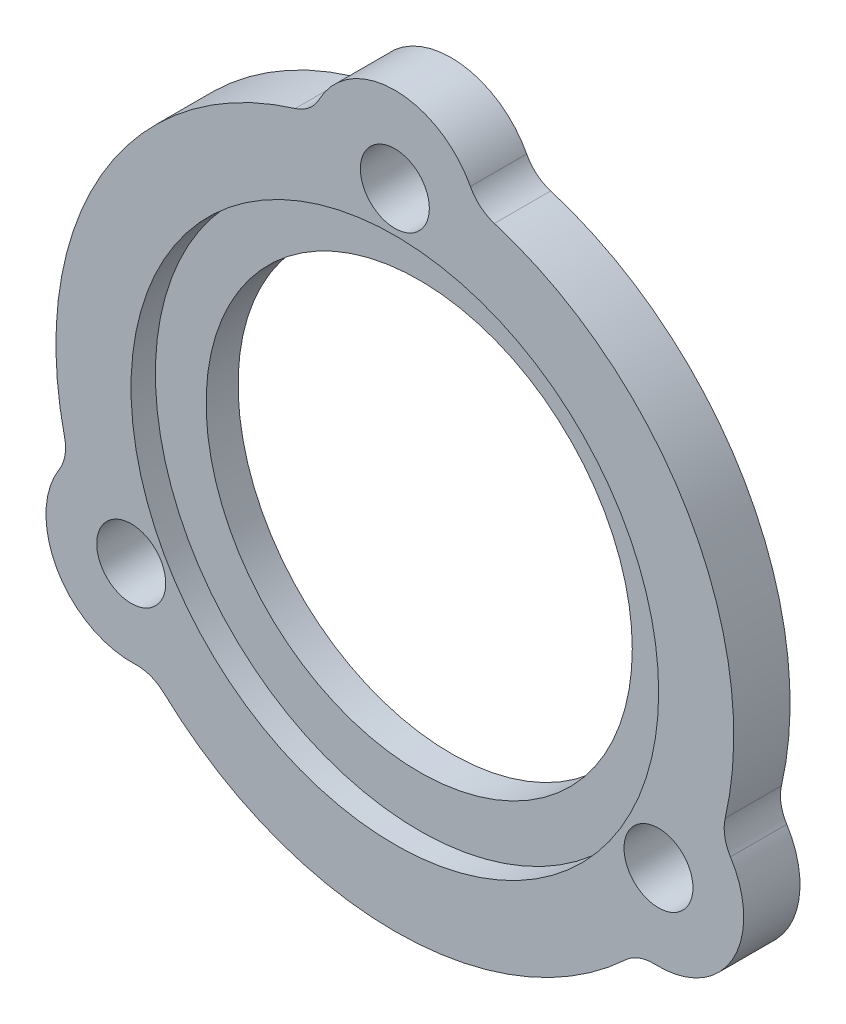
ISO-10303-21;
HEADER;
FILE_DESCRIPTION(('STEP AP214'),'2;1');
FILE_NAME('part.step','',(''),(''),'','','');
FILE_SCHEMA(('AUTOMOTIVE_DESIGN { 1 0 10303 214 1 1 1 1 }'));
ENDSEC;
DATA;
#1=APPLICATION_CONTEXT('core data for automotive mechanical design processes');
#2=APPLICATION_PROTOCOL_DEFINITION('international standard','automotive_design',2000,#1);
#3=PRODUCT_CONTEXT('',#1,'mechanical');
#4=PRODUCT('Part','Part','',(#3));
#5=PRODUCT_RELATED_PRODUCT_CATEGORY('part','',(#4));
#6=PRODUCT_DEFINITION_FORMATION('','',#4);
#7=PRODUCT_DEFINITION_CONTEXT('part definition',#1,'design');
#8=PRODUCT_DEFINITION('design','',#6,#7);
#9=PRODUCT_DEFINITION_SHAPE('','',#8);
#10=(LENGTH_UNIT() NAMED_UNIT(*) SI_UNIT(.MILLI.,.METRE.));
#11=(NAMED_UNIT(*) PLANE_ANGLE_UNIT() SI_UNIT($,.RADIAN.));
#12=(NAMED_UNIT(*) SI_UNIT($,.STERADIAN.) SOLID_ANGLE_UNIT());
#13=UNCERTAINTY_MEASURE_WITH_UNIT(LENGTH_MEASURE(1.E-05),#10,'distance_accuracy_value','');
#14=(GEOMETRIC_REPRESENTATION_CONTEXT(3) GLOBAL_UNCERTAINTY_ASSIGNED_CONTEXT((#13)) GLOBAL_UNIT_ASSIGNED_CONTEXT((#10,
#11,#12)) REPRESENTATION_CONTEXT('',''));
#15=CARTESIAN_POINT('',(0.,0.,0.));
#16=DIRECTION('',(0.,0.,1.));
#17=DIRECTION('',(1.,0.,0.));
#18=AXIS2_PLACEMENT_3D('',#15,#16,#17);
#19=CARTESIAN_POINT('',(16.4977839420932,-9.5249999999993,1.524));
#20=DIRECTION('',(0.,0.,-1.));
#21=DIRECTION('',(-1.,0.,0.));
#22=AXIS2_PLACEMENT_3D('',#19,#20,#21);
#23=CYLINDRICAL_SURFACE('',#22,5.334);
#24=CARTESIAN_POINT('',(16.4977839420932,-9.5249999999993,-2.));
#25=DIRECTION('',(0.,0.,1.));
#26=DIRECTION('',(1.,0.,0.));
#27=AXIS2_PLACEMENT_3D('',#24,#25,#26);
#28=CIRCLE('',#27,5.334);
#29=CARTESIAN_POINT('',(16.2769070344323,-14.8544248649976,-2.));
#30=VERTEX_POINT('',#29);
#31=CARTESIAN_POINT('',(21.0027628089116,-6.66900255435631,-2.));
#32=VERTEX_POINT('',#31);
#33=EDGE_CURVE('E161',#30,#32,#28,.T.);
#34=ORIENTED_EDGE('',*,*,#33,.T.);
#35=DIRECTION('',(0.,0.,-1.));
#36=VECTOR('',#35,1.);
#37=CARTESIAN_POINT('',(21.0027628089116,-6.66900255435631,1.524));
#38=LINE('',#37,#36);
#39=CARTESIAN_POINT('',(21.0027628089116,-6.66900255435631,1.524));
#40=VERTEX_POINT('',#39);
#41=EDGE_CURVE('E205',#32,#40,#38,.F.);
#42=ORIENTED_EDGE('',*,*,#41,.T.);
#43=CARTESIAN_POINT('',(16.4977839420932,-9.5249999999993,1.524));
#44=DIRECTION('',(0.,0.,1.));
#45=DIRECTION('',(1.,0.,0.));
#46=AXIS2_PLACEMENT_3D('',#43,#44,#45);
#47=CIRCLE('',#46,5.334);
#48=CARTESIAN_POINT('',(16.2769070344323,-14.8544248649976,1.524));
#49=VERTEX_POINT('',#48);
#50=EDGE_CURVE('E181',#49,#40,#47,.T.);
#51=ORIENTED_EDGE('',*,*,#50,.F.);
#52=DIRECTION('',(0.,0.,-1.));
#53=VECTOR('',#52,1.);
#54=CARTESIAN_POINT('',(16.2769070344323,-14.8544248649976,1.524));
#55=LINE('',#54,#53);
#56=EDGE_CURVE('E202',#49,#30,#55,.T.);
#57=ORIENTED_EDGE('',*,*,#56,.T.);
#58=EDGE_LOOP('',(#34,#42,#51,#57));
#59=FACE_BOUND('',#58,.T.);
#60=ADVANCED_FACE('F42',(#59),#23,.T.);
#61=CARTESIAN_POINT('',(0.,0.,1.524));
#62=DIRECTION('',(0.,0.,-1.));
#63=DIRECTION('',(-1.,0.,0.));
#64=AXIS2_PLACEMENT_3D('',#61,#62,#63);
#65=CYLINDRICAL_SURFACE('',#64,21.209);
#66=CARTESIAN_POINT('',(0.,0.,-2.));
#67=DIRECTION('',(0.,0.,1.));
#68=DIRECTION('',(1.,0.,0.));
#69=AXIS2_PLACEMENT_3D('',#66,#67,#68);
#70=CIRCLE('',#69,21.209);
#71=CARTESIAN_POINT('',(20.6722698951973,-4.74119588080056,-2.));
#72=VERTEX_POINT('',#71);
#73=CARTESIAN_POINT('',(6.23013887050718,20.2733088235294,-2.));
#74=VERTEX_POINT('',#73);
#75=EDGE_CURVE('E157',#72,#74,#70,.T.);
#76=ORIENTED_EDGE('',*,*,#75,.T.);
#77=DIRECTION('',(0.,0.,-1.));
#78=VECTOR('',#77,1.);
#79=CARTESIAN_POINT('',(6.23013887050718,20.2733088235294,1.524));
#80=LINE('',#79,#78);
#81=CARTESIAN_POINT('',(6.23013887050718,20.2733088235294,1.524));
#82=VERTEX_POINT('',#81);
#83=EDGE_CURVE('E136',#74,#82,#80,.F.);
#84=ORIENTED_EDGE('',*,*,#83,.T.);
#85=CARTESIAN_POINT('',(0.,0.,1.524));
#86=DIRECTION('',(0.,0.,1.));
#87=DIRECTION('',(1.,0.,0.));
#88=AXIS2_PLACEMENT_3D('',#85,#86,#87);
#89=CIRCLE('',#88,21.209);
#90=CARTESIAN_POINT('',(20.6722698951973,-4.74119588080056,1.524));
#91=VERTEX_POINT('',#90);
#92=EDGE_CURVE('E184',#91,#82,#89,.T.);
#93=ORIENTED_EDGE('',*,*,#92,.F.);
#94=DIRECTION('',(0.,0.,-1.));
#95=VECTOR('',#94,1.);
#96=CARTESIAN_POINT('',(20.6722698951973,-4.74119588080056,1.524));
#97=LINE('',#96,#95);
#98=EDGE_CURVE('E150',#91,#72,#97,.T.);
#99=ORIENTED_EDGE('',*,*,#98,.T.);
#100=EDGE_LOOP('',(#76,#84,#93,#99));
#101=FACE_BOUND('',#100,.T.);
#102=ADVANCED_FACE('F256',(#101),#65,.T.);
#103=CARTESIAN_POINT('',(0.,19.05,1.524));
#104=DIRECTION('',(0.,0.,-1.));
#105=DIRECTION('',(-1.,0.,0.));
#106=AXIS2_PLACEMENT_3D('',#103,#104,#105);
#107=CYLINDRICAL_SURFACE('',#106,5.334);
#108=CARTESIAN_POINT('',(0.,19.05,1.524));
#109=DIRECTION('',(0.,0.,1.));
#110=DIRECTION('',(1.,0.,0.));
#111=AXIS2_PLACEMENT_3D('',#108,#109,#110);
#112=CIRCLE('',#111,5.334);
#113=CARTESIAN_POINT('',(4.72585577447976,21.5234274193548,1.524));
#114=VERTEX_POINT('',#113);
#115=CARTESIAN_POINT('',(-4.72585577447976,21.5234274193548,1.524));
#116=VERTEX_POINT('',#115);
#117=EDGE_CURVE('E149',#114,#116,#112,.T.);
#118=ORIENTED_EDGE('',*,*,#117,.F.);
#119=DIRECTION('',(0.,0.,-1.));
#120=VECTOR('',#119,1.);
#121=CARTESIAN_POINT('',(4.72585577447976,21.5234274193548,1.524));
#122=LINE('',#121,#120);
#123=CARTESIAN_POINT('',(4.72585577447976,21.5234274193548,-2.));
#124=VERTEX_POINT('',#123);
#125=EDGE_CURVE('E135',#114,#124,#122,.T.);
#126=ORIENTED_EDGE('',*,*,#125,.T.);
#127=CARTESIAN_POINT('',(0.,19.05,-2.));
#128=DIRECTION('',(0.,0.,1.));
#129=DIRECTION('',(1.,0.,0.));
#130=AXIS2_PLACEMENT_3D('',#127,#128,#129);
#131=CIRCLE('',#130,5.334);
#132=CARTESIAN_POINT('',(-4.72585577447976,21.5234274193548,-2.));
#133=VERTEX_POINT('',#132);
#134=EDGE_CURVE('E147',#124,#133,#131,.T.);
#135=ORIENTED_EDGE('',*,*,#134,.T.);
#136=DIRECTION('',(0.,0.,-1.));
#137=VECTOR('',#136,1.);
#138=CARTESIAN_POINT('',(-4.72585577447976,21.5234274193548,1.524));
#139=LINE('',#138,#137);
#140=EDGE_CURVE('E151',#133,#116,#139,.F.);
#141=ORIENTED_EDGE('',*,*,#140,.T.);
#142=EDGE_LOOP('',(#118,#126,#135,#141));
#143=FACE_BOUND('',#142,.T.);
#144=ADVANCED_FACE('F146',(#143),#107,.T.);
#145=CARTESIAN_POINT('',(0.,0.,1.524));
#146=DIRECTION('',(0.,0.,-1.));
#147=DIRECTION('',(-1.,0.,0.));
#148=AXIS2_PLACEMENT_3D('',#145,#146,#147);
#149=CYLINDRICAL_SURFACE('',#148,21.209);
#150=CARTESIAN_POINT('',(0.,0.,-2.));
#151=DIRECTION('',(0.,0.,1.));
#152=DIRECTION('',(1.,0.,0.));
#153=AXIS2_PLACEMENT_3D('',#150,#151,#152);
#154=CIRCLE('',#153,21.209);
#155=CARTESIAN_POINT('',(-6.23013887050718,20.2733088235294,-2.));
#156=VERTEX_POINT('',#155);
#157=CARTESIAN_POINT('',(-20.6722698951973,-4.74119588080057,-2.));
#158=VERTEX_POINT('',#157);
#159=EDGE_CURVE('E156',#156,#158,#154,.T.);
#160=ORIENTED_EDGE('',*,*,#159,.T.);
#161=DIRECTION('',(0.,0.,-1.));
#162=VECTOR('',#161,1.);
#163=CARTESIAN_POINT('',(-20.6722698951973,-4.74119588080057,1.524));
#164=LINE('',#163,#162);
#165=CARTESIAN_POINT('',(-20.6722698951973,-4.74119588080057,1.524));
#166=VERTEX_POINT('',#165);
#167=EDGE_CURVE('E57',#158,#166,#164,.F.);
#168=ORIENTED_EDGE('',*,*,#167,.T.);
#169=CARTESIAN_POINT('',(0.,0.,1.524));
#170=DIRECTION('',(0.,0.,1.));
#171=DIRECTION('',(1.,0.,0.));
#172=AXIS2_PLACEMENT_3D('',#169,#170,#171);
#173=CIRCLE('',#172,21.209);
#174=CARTESIAN_POINT('',(-6.23013887050718,20.2733088235294,1.524));
#175=VERTEX_POINT('',#174);
#176=EDGE_CURVE('E188',#175,#166,#173,.T.);
#177=ORIENTED_EDGE('',*,*,#176,.F.);
#178=DIRECTION('',(0.,0.,-1.));
#179=VECTOR('',#178,1.);
#180=CARTESIAN_POINT('',(-6.23013887050718,20.2733088235294,1.524));
#181=LINE('',#180,#179);
#182=EDGE_CURVE('E217',#175,#156,#181,.T.);
#183=ORIENTED_EDGE('',*,*,#182,.T.);
#184=EDGE_LOOP('',(#160,#168,#177,#183));
#185=FACE_BOUND('',#184,.T.);
#186=ADVANCED_FACE('F249',(#185),#149,.T.);
#187=CARTESIAN_POINT('',(-16.4977839420932,-9.52499999999931,1.524));
#188=DIRECTION('',(0.,0.,-1.));
#189=DIRECTION('',(-1.,0.,0.));
#190=AXIS2_PLACEMENT_3D('',#187,#188,#189);
#191=CYLINDRICAL_SURFACE('',#190,5.334);
#192=CARTESIAN_POINT('',(-16.4977839420932,-9.52499999999931,-2.));
#193=DIRECTION('',(0.,0.,1.));
#194=DIRECTION('',(1.,0.,0.));
#195=AXIS2_PLACEMENT_3D('',#192,#193,#194);
#196=CIRCLE('',#195,5.334);
#197=CARTESIAN_POINT('',(-21.0027628089116,-6.66900255435632,-2.));
#198=VERTEX_POINT('',#197);
#199=CARTESIAN_POINT('',(-16.2769070344323,-14.8544248649976,-2.));
#200=VERTEX_POINT('',#199);
#201=EDGE_CURVE('E248',#198,#200,#196,.T.);
#202=ORIENTED_EDGE('',*,*,#201,.T.);
#203=DIRECTION('',(0.,0.,-1.));
#204=VECTOR('',#203,1.);
#205=CARTESIAN_POINT('',(-16.2769070344323,-14.8544248649976,1.524));
#206=LINE('',#205,#204);
#207=CARTESIAN_POINT('',(-16.2769070344323,-14.8544248649976,1.524));
#208=VERTEX_POINT('',#207);
#209=EDGE_CURVE('E215',#200,#208,#206,.F.);
#210=ORIENTED_EDGE('',*,*,#209,.T.);
#211=CARTESIAN_POINT('',(-16.4977839420932,-9.52499999999931,1.524));
#212=DIRECTION('',(0.,0.,1.));
#213=DIRECTION('',(1.,0.,0.));
#214=AXIS2_PLACEMENT_3D('',#211,#212,#213);
#215=CIRCLE('',#214,5.334);
#216=CARTESIAN_POINT('',(-21.0027628089116,-6.66900255435632,1.524));
#217=VERTEX_POINT('',#216);
#218=EDGE_CURVE('E190',#217,#208,#215,.T.);
#219=ORIENTED_EDGE('',*,*,#218,.F.);
#220=DIRECTION('',(0.,0.,-1.));
#221=VECTOR('',#220,1.);
#222=CARTESIAN_POINT('',(-21.0027628089116,-6.66900255435632,1.524));
#223=LINE('',#222,#221);
#224=EDGE_CURVE('E212',#217,#198,#223,.T.);
#225=ORIENTED_EDGE('',*,*,#224,.T.);
#226=EDGE_LOOP('',(#202,#210,#219,#225));
#227=FACE_BOUND('',#226,.T.);
#228=ADVANCED_FACE('F245',(#227),#191,.T.);
#229=CARTESIAN_POINT('',(0.,0.,1.524));
#230=DIRECTION('',(0.,0.,-1.));
#231=DIRECTION('',(-1.,0.,0.));
#232=AXIS2_PLACEMENT_3D('',#229,#230,#231);
#233=CYLINDRICAL_SURFACE('',#232,16.51);
#234=CARTESIAN_POINT('',(0.,0.,1.524));
#235=DIRECTION('',(0.,0.,1.));
#236=DIRECTION('',(1.,0.,0.));
#237=AXIS2_PLACEMENT_3D('',#234,#235,#236);
#238=CIRCLE('',#237,16.51);
#239=CARTESIAN_POINT('',(16.51,0.,1.524));
#240=VERTEX_POINT('',#239);
#241=EDGE_CURVE('E178',#240,#240,#238,.T.);
#242=ORIENTED_EDGE('',*,*,#241,.T.);
#243=EDGE_LOOP('',(#242));
#244=FACE_BOUND('',#243,.T.);
#245=CARTESIAN_POINT('',(0.,0.,0.));
#246=DIRECTION('',(0.,0.,1.));
#247=DIRECTION('',(1.,0.,0.));
#248=AXIS2_PLACEMENT_3D('',#245,#246,#247);
#249=CIRCLE('',#248,16.51);
#250=CARTESIAN_POINT('',(16.51,0.,0.));
#251=VERTEX_POINT('',#250);
#252=EDGE_CURVE('E159',#251,#251,#249,.T.);
#253=ORIENTED_EDGE('',*,*,#252,.F.);
#254=EDGE_LOOP('',(#253));
#255=FACE_BOUND('',#254,.T.);
#256=ADVANCED_FACE('F308',(#244,#255),#233,.F.);
#257=CARTESIAN_POINT('',(-16.4977839420932,-9.52499999999931,1.524));
#258=DIRECTION('',(0.,0.,-1.));
#259=DIRECTION('',(-1.,0.,0.));
#260=AXIS2_PLACEMENT_3D('',#257,#258,#259);
#261=CYLINDRICAL_SURFACE('',#260,2.15899999999998);
#262=CARTESIAN_POINT('',(-16.4977839420932,-9.52499999999931,1.524));
#263=DIRECTION('',(0.,0.,1.));
#264=DIRECTION('',(1.,0.,0.));
#265=AXIS2_PLACEMENT_3D('',#262,#263,#264);
#266=CIRCLE('',#265,2.15899999999998);
#267=CARTESIAN_POINT('',(-14.3387839420932,-9.52499999999931,1.524));
#268=VERTEX_POINT('',#267);
#269=EDGE_CURVE('E175',#268,#268,#266,.T.);
#270=ORIENTED_EDGE('',*,*,#269,.T.);
#271=EDGE_LOOP('',(#270));
#272=FACE_BOUND('',#271,.T.);
#273=CARTESIAN_POINT('',(-16.4977839420932,-9.52499999999931,-2.));
#274=DIRECTION('',(0.,0.,1.));
#275=DIRECTION('',(1.,0.,0.));
#276=AXIS2_PLACEMENT_3D('',#273,#274,#275);
#277=CIRCLE('',#276,2.15899999999998);
#278=CARTESIAN_POINT('',(-14.3387839420932,-9.52499999999931,-2.));
#279=VERTEX_POINT('',#278);
#280=EDGE_CURVE('E276',#279,#279,#277,.T.);
#281=ORIENTED_EDGE('',*,*,#280,.F.);
#282=EDGE_LOOP('',(#281));
#283=FACE_BOUND('',#282,.T.);
#284=ADVANCED_FACE('F296',(#272,#283),#261,.F.);
#285=CARTESIAN_POINT('',(16.4977839420932,-9.5249999999993,1.524));
#286=DIRECTION('',(0.,0.,-1.));
#287=DIRECTION('',(-1.,0.,0.));
#288=AXIS2_PLACEMENT_3D('',#285,#286,#287);
#289=CYLINDRICAL_SURFACE('',#288,2.15900000000067);
#290=CARTESIAN_POINT('',(16.4977839420932,-9.5249999999993,1.524));
#291=DIRECTION('',(0.,0.,1.));
#292=DIRECTION('',(1.,0.,0.));
#293=AXIS2_PLACEMENT_3D('',#290,#291,#292);
#294=CIRCLE('',#293,2.15900000000067);
#295=CARTESIAN_POINT('',(18.6567839420938,-9.5249999999993,1.524));
#296=VERTEX_POINT('',#295);
#297=EDGE_CURVE('E172',#296,#296,#294,.T.);
#298=ORIENTED_EDGE('',*,*,#297,.T.);
#299=EDGE_LOOP('',(#298));
#300=FACE_BOUND('',#299,.T.);
#301=CARTESIAN_POINT('',(16.4977839420932,-9.5249999999993,-2.));
#302=DIRECTION('',(0.,0.,1.));
#303=DIRECTION('',(1.,0.,0.));
#304=AXIS2_PLACEMENT_3D('',#301,#302,#303);
#305=CIRCLE('',#304,2.15900000000067);
#306=CARTESIAN_POINT('',(18.6567839420938,-9.5249999999993,-2.));
#307=VERTEX_POINT('',#306);
#308=EDGE_CURVE('E270',#307,#307,#305,.T.);
#309=ORIENTED_EDGE('',*,*,#308,.F.);
#310=EDGE_LOOP('',(#309));
#311=FACE_BOUND('',#310,.T.);
#312=ADVANCED_FACE('F287',(#300,#311),#289,.F.);
#313=CARTESIAN_POINT('',(0.,19.05,1.524));
#314=DIRECTION('',(0.,0.,-1.));
#315=DIRECTION('',(-1.,0.,0.));
#316=AXIS2_PLACEMENT_3D('',#313,#314,#315);
#317=CYLINDRICAL_SURFACE('',#316,2.159);
#318=CARTESIAN_POINT('',(0.,19.05,1.524));
#319=DIRECTION('',(0.,0.,1.));
#320=DIRECTION('',(1.,0.,0.));
#321=AXIS2_PLACEMENT_3D('',#318,#319,#320);
#322=CIRCLE('',#321,2.159);
#323=CARTESIAN_POINT('',(2.159,19.05,1.524));
#324=VERTEX_POINT('',#323);
#325=EDGE_CURVE('E169',#324,#324,#322,.T.);
#326=ORIENTED_EDGE('',*,*,#325,.T.);
#327=EDGE_LOOP('',(#326));
#328=FACE_BOUND('',#327,.T.);
#329=CARTESIAN_POINT('',(0.,19.05,-2.));
#330=DIRECTION('',(0.,0.,1.));
#331=DIRECTION('',(1.,0.,0.));
#332=AXIS2_PLACEMENT_3D('',#329,#330,#331);
#333=CIRCLE('',#332,2.159);
#334=CARTESIAN_POINT('',(2.159,19.05,-2.));
#335=VERTEX_POINT('',#334);
#336=EDGE_CURVE('E168',#335,#335,#333,.T.);
#337=ORIENTED_EDGE('',*,*,#336,.F.);
#338=EDGE_LOOP('',(#337));
#339=FACE_BOUND('',#338,.T.);
#340=ADVANCED_FACE('F284',(#328,#339),#317,.F.);
#341=CARTESIAN_POINT('',(0.,0.,1.524));
#342=DIRECTION('',(0.,0.,-1.));
#343=DIRECTION('',(-1.,0.,0.));
#344=AXIS2_PLACEMENT_3D('',#341,#342,#343);
#345=CYLINDRICAL_SURFACE('',#344,21.209);
#346=CARTESIAN_POINT('',(0.,0.,-2.));
#347=DIRECTION('',(0.,0.,1.));
#348=DIRECTION('',(1.,0.,0.));
#349=AXIS2_PLACEMENT_3D('',#346,#347,#348);
#350=CIRCLE('',#349,21.209);
#351=CARTESIAN_POINT('',(-14.4421310246907,-15.5321129427282,-2.));
#352=VERTEX_POINT('',#351);
#353=CARTESIAN_POINT('',(14.4421310246907,-15.5321129427282,-2.));
#354=VERTEX_POINT('',#353);
#355=EDGE_CURVE('E265',#352,#354,#350,.T.);
#356=ORIENTED_EDGE('',*,*,#355,.T.);
#357=DIRECTION('',(0.,0.,-1.));
#358=VECTOR('',#357,1.);
#359=CARTESIAN_POINT('',(14.4421310246907,-15.5321129427282,1.524));
#360=LINE('',#359,#358);
#361=CARTESIAN_POINT('',(14.4421310246907,-15.5321129427282,1.524));
#362=VERTEX_POINT('',#361);
#363=EDGE_CURVE('E210',#354,#362,#360,.F.);
#364=ORIENTED_EDGE('',*,*,#363,.T.);
#365=CARTESIAN_POINT('',(0.,0.,1.524));
#366=DIRECTION('',(0.,0.,1.));
#367=DIRECTION('',(1.,0.,0.));
#368=AXIS2_PLACEMENT_3D('',#365,#366,#367);
#369=CIRCLE('',#368,21.209);
#370=CARTESIAN_POINT('',(-14.4421310246907,-15.5321129427282,1.524));
#371=VERTEX_POINT('',#370);
#372=EDGE_CURVE('E193',#371,#362,#369,.T.);
#373=ORIENTED_EDGE('',*,*,#372,.F.);
#374=DIRECTION('',(0.,0.,-1.));
#375=VECTOR('',#374,1.);
#376=CARTESIAN_POINT('',(-14.4421310246907,-15.5321129427282,1.524));
#377=LINE('',#376,#375);
#378=EDGE_CURVE('E207',#371,#352,#377,.T.);
#379=ORIENTED_EDGE('',*,*,#378,.T.);
#380=EDGE_LOOP('',(#356,#364,#373,#379));
#381=FACE_BOUND('',#380,.T.);
#382=ADVANCED_FACE('F286',(#381),#345,.T.);
#383=CARTESIAN_POINT('',(0.,0.,1.524));
#384=DIRECTION('',(0.,0.,1.));
#385=DIRECTION('',(1.,0.,0.));
#386=AXIS2_PLACEMENT_3D('',#383,#384,#385);
#387=PLANE('',#386);
#388=ORIENTED_EDGE('',*,*,#325,.F.);
#389=EDGE_LOOP('',(#388));
#390=FACE_BOUND('',#389,.T.);
#391=ORIENTED_EDGE('',*,*,#297,.F.);
#392=EDGE_LOOP('',(#391));
#393=FACE_BOUND('',#392,.T.);
#394=ORIENTED_EDGE('',*,*,#269,.F.);
#395=EDGE_LOOP('',(#394));
#396=FACE_BOUND('',#395,.T.);
#397=ORIENTED_EDGE('',*,*,#241,.F.);
#398=EDGE_LOOP('',(#397));
#399=FACE_BOUND('',#398,.T.);
#400=ORIENTED_EDGE('',*,*,#372,.T.);
#401=CARTESIAN_POINT('',(16.1717275545938,-17.3922462292825,1.524));
#402=DIRECTION('',(0.,0.,1.));
#403=DIRECTION('',(1.,0.,0.));
#404=AXIS2_PLACEMENT_3D('',#401,#402,#403);
#405=CIRCLE('',#404,2.54);
#406=EDGE_CURVE('E228',#362,#49,#405,.F.);
#407=ORIENTED_EDGE('',*,*,#406,.T.);
#408=ORIENTED_EDGE('',*,*,#50,.T.);
#409=CARTESIAN_POINT('',(23.1479908407299,-5.3090037707168,1.524));
#410=DIRECTION('',(0.,0.,1.));
#411=DIRECTION('',(1.,0.,0.));
#412=AXIS2_PLACEMENT_3D('',#409,#410,#411);
#413=CIRCLE('',#412,2.54);
#414=EDGE_CURVE('E224',#40,#91,#413,.F.);
#415=ORIENTED_EDGE('',*,*,#414,.T.);
#416=ORIENTED_EDGE('',*,*,#92,.T.);
#417=CARTESIAN_POINT('',(6.97626328613679,22.70125,1.524));
#418=DIRECTION('',(0.,0.,1.));
#419=DIRECTION('',(1.,0.,0.));
#420=AXIS2_PLACEMENT_3D('',#417,#418,#419);
#421=CIRCLE('',#420,2.54);
#422=EDGE_CURVE('E141',#82,#114,#421,.F.);
#423=ORIENTED_EDGE('',*,*,#422,.T.);
#424=ORIENTED_EDGE('',*,*,#117,.T.);
#425=CARTESIAN_POINT('',(-6.97626328613679,22.70125,1.524));
#426=DIRECTION('',(0.,0.,1.));
#427=DIRECTION('',(1.,0.,0.));
#428=AXIS2_PLACEMENT_3D('',#425,#426,#427);
#429=CIRCLE('',#428,2.54);
#430=EDGE_CURVE('E11',#116,#175,#429,.F.);
#431=ORIENTED_EDGE('',*,*,#430,.T.);
#432=ORIENTED_EDGE('',*,*,#176,.T.);
#433=CARTESIAN_POINT('',(-23.1479908407299,-5.30900377071681,1.524));
#434=DIRECTION('',(0.,0.,1.));
#435=DIRECTION('',(1.,0.,0.));
#436=AXIS2_PLACEMENT_3D('',#433,#434,#435);
#437=CIRCLE('',#436,2.54);
#438=EDGE_CURVE('E236',#166,#217,#437,.F.);
#439=ORIENTED_EDGE('',*,*,#438,.T.);
#440=ORIENTED_EDGE('',*,*,#218,.T.);
#441=CARTESIAN_POINT('',(-16.1717275545938,-17.3922462292825,1.524));
#442=DIRECTION('',(0.,0.,1.));
#443=DIRECTION('',(1.,0.,0.));
#444=AXIS2_PLACEMENT_3D('',#441,#442,#443);
#445=CIRCLE('',#444,2.54);
#446=EDGE_CURVE('E232',#208,#371,#445,.F.);
#447=ORIENTED_EDGE('',*,*,#446,.T.);
#448=EDGE_LOOP('',(#400,#407,#408,#415,#416,#423,#424,#431,#432,#439,#440,#447));
#449=FACE_BOUND('',#448,.T.);
#450=ADVANCED_FACE('F239',(#390,#393,#396,#399,#449),#387,.T.);
#451=CARTESIAN_POINT('',(0.,0.,0.));
#452=DIRECTION('',(0.,0.,1.));
#453=DIRECTION('',(1.,0.,0.));
#454=AXIS2_PLACEMENT_3D('',#451,#452,#453);
#455=PLANE('',#454);
#456=CARTESIAN_POINT('',(0.,0.,0.));
#457=DIRECTION('',(0.,0.,1.));
#458=DIRECTION('',(1.,0.,0.));
#459=AXIS2_PLACEMENT_3D('',#456,#457,#458);
#460=CIRCLE('',#459,13.335);
#461=CARTESIAN_POINT('',(13.335,0.,0.));
#462=VERTEX_POINT('',#461);
#463=EDGE_CURVE('E165',#462,#462,#460,.T.);
#464=ORIENTED_EDGE('',*,*,#463,.F.);
#465=EDGE_LOOP('',(#464));
#466=FACE_BOUND('',#465,.T.);
#467=ORIENTED_EDGE('',*,*,#252,.T.);
#468=EDGE_LOOP('',(#467));
#469=FACE_BOUND('',#468,.T.);
#470=ADVANCED_FACE('F330',(#466,#469),#455,.T.);
#471=CARTESIAN_POINT('',(0.,0.,-2.));
#472=DIRECTION('',(0.,0.,1.));
#473=DIRECTION('',(1.,0.,0.));
#474=AXIS2_PLACEMENT_3D('',#471,#472,#473);
#475=CYLINDRICAL_SURFACE('',#474,13.335);
#476=CARTESIAN_POINT('',(0.,0.,-2.));
#477=DIRECTION('',(0.,0.,1.));
#478=DIRECTION('',(1.,0.,0.));
#479=AXIS2_PLACEMENT_3D('',#476,#477,#478);
#480=CIRCLE('',#479,13.335);
#481=CARTESIAN_POINT('',(13.335,0.,-2.));
#482=VERTEX_POINT('',#481);
#483=EDGE_CURVE('E273',#482,#482,#480,.T.);
#484=ORIENTED_EDGE('',*,*,#483,.F.);
#485=EDGE_LOOP('',(#484));
#486=FACE_BOUND('',#485,.T.);
#487=ORIENTED_EDGE('',*,*,#463,.T.);
#488=EDGE_LOOP('',(#487));
#489=FACE_BOUND('',#488,.T.);
#490=ADVANCED_FACE('F321',(#486,#489),#475,.F.);
#491=CARTESIAN_POINT('',(0.,0.,-2.));
#492=DIRECTION('',(0.,0.,1.));
#493=DIRECTION('',(1.,0.,0.));
#494=AXIS2_PLACEMENT_3D('',#491,#492,#493);
#495=PLANE('',#494);
#496=ORIENTED_EDGE('',*,*,#336,.T.);
#497=EDGE_LOOP('',(#496));
#498=FACE_BOUND('',#497,.T.);
#499=ORIENTED_EDGE('',*,*,#280,.T.);
#500=EDGE_LOOP('',(#499));
#501=FACE_BOUND('',#500,.T.);
#502=ORIENTED_EDGE('',*,*,#483,.T.);
#503=EDGE_LOOP('',(#502));
#504=FACE_BOUND('',#503,.T.);
#505=ORIENTED_EDGE('',*,*,#308,.T.);
#506=EDGE_LOOP('',(#505));
#507=FACE_BOUND('',#506,.T.);
#508=ORIENTED_EDGE('',*,*,#201,.F.);
#509=CARTESIAN_POINT('',(-23.1479908407299,-5.30900377071681,-2.));
#510=DIRECTION('',(0.,0.,1.));
#511=DIRECTION('',(1.,0.,0.));
#512=AXIS2_PLACEMENT_3D('',#509,#510,#511);
#513=CIRCLE('',#512,2.54);
#514=EDGE_CURVE('E234',#198,#158,#513,.T.);
#515=ORIENTED_EDGE('',*,*,#514,.T.);
#516=ORIENTED_EDGE('',*,*,#159,.F.);
#517=CARTESIAN_POINT('',(-6.97626328613679,22.70125,-2.));
#518=DIRECTION('',(0.,0.,1.));
#519=DIRECTION('',(1.,0.,0.));
#520=AXIS2_PLACEMENT_3D('',#517,#518,#519);
#521=CIRCLE('',#520,2.54);
#522=EDGE_CURVE('E50',#156,#133,#521,.T.);
#523=ORIENTED_EDGE('',*,*,#522,.T.);
#524=ORIENTED_EDGE('',*,*,#134,.F.);
#525=CARTESIAN_POINT('',(6.97626328613679,22.70125,-2.));
#526=DIRECTION('',(0.,0.,1.));
#527=DIRECTION('',(1.,0.,0.));
#528=AXIS2_PLACEMENT_3D('',#525,#526,#527);
#529=CIRCLE('',#528,2.54);
#530=EDGE_CURVE('E131',#124,#74,#529,.T.);
#531=ORIENTED_EDGE('',*,*,#530,.T.);
#532=ORIENTED_EDGE('',*,*,#75,.F.);
#533=CARTESIAN_POINT('',(23.1479908407299,-5.3090037707168,-2.));
#534=DIRECTION('',(0.,0.,1.));
#535=DIRECTION('',(1.,0.,0.));
#536=AXIS2_PLACEMENT_3D('',#533,#534,#535);
#537=CIRCLE('',#536,2.54);
#538=EDGE_CURVE('E222',#72,#32,#537,.T.);
#539=ORIENTED_EDGE('',*,*,#538,.T.);
#540=ORIENTED_EDGE('',*,*,#33,.F.);
#541=CARTESIAN_POINT('',(16.1717275545938,-17.3922462292825,-2.));
#542=DIRECTION('',(0.,0.,1.));
#543=DIRECTION('',(1.,0.,0.));
#544=AXIS2_PLACEMENT_3D('',#541,#542,#543);
#545=CIRCLE('',#544,2.54);
#546=EDGE_CURVE('E226',#30,#354,#545,.T.);
#547=ORIENTED_EDGE('',*,*,#546,.T.);
#548=ORIENTED_EDGE('',*,*,#355,.F.);
#549=CARTESIAN_POINT('',(-16.1717275545938,-17.3922462292825,-2.));
#550=DIRECTION('',(0.,0.,1.));
#551=DIRECTION('',(1.,0.,0.));
#552=AXIS2_PLACEMENT_3D('',#549,#550,#551);
#553=CIRCLE('',#552,2.54);
#554=EDGE_CURVE('E230',#352,#200,#553,.T.);
#555=ORIENTED_EDGE('',*,*,#554,.T.);
#556=EDGE_LOOP('',(#508,#515,#516,#523,#524,#531,#532,#539,#540,#547,#548,#555));
#557=FACE_BOUND('',#556,.T.);
#558=ADVANCED_FACE('F154',(#498,#501,#504,#507,#557),#495,.F.);
#559=CARTESIAN_POINT('',(6.97626328613679,22.70125,1.524));
#560=DIRECTION('',(0.,0.,1.));
#561=DIRECTION('',(1.,0.,0.));
#562=AXIS2_PLACEMENT_3D('',#559,#560,#561);
#563=CYLINDRICAL_SURFACE('',#562,2.54);
#564=ORIENTED_EDGE('',*,*,#422,.F.);
#565=ORIENTED_EDGE('',*,*,#83,.F.);
#566=ORIENTED_EDGE('',*,*,#530,.F.);
#567=ORIENTED_EDGE('',*,*,#125,.F.);
#568=EDGE_LOOP('',(#564,#565,#566,#567));
#569=FACE_BOUND('',#568,.T.);
#570=ADVANCED_FACE('F134',(#569),#563,.F.);
#571=CARTESIAN_POINT('',(23.1479908407299,-5.3090037707168,1.524));
#572=DIRECTION('',(0.,0.,1.));
#573=DIRECTION('',(1.,0.,0.));
#574=AXIS2_PLACEMENT_3D('',#571,#572,#573);
#575=CYLINDRICAL_SURFACE('',#574,2.54);
#576=ORIENTED_EDGE('',*,*,#414,.F.);
#577=ORIENTED_EDGE('',*,*,#41,.F.);
#578=ORIENTED_EDGE('',*,*,#538,.F.);
#579=ORIENTED_EDGE('',*,*,#98,.F.);
#580=EDGE_LOOP('',(#576,#577,#578,#579));
#581=FACE_BOUND('',#580,.T.);
#582=ADVANCED_FACE('F258',(#581),#575,.F.);
#583=CARTESIAN_POINT('',(16.1717275545938,-17.3922462292825,1.524));
#584=DIRECTION('',(0.,0.,1.));
#585=DIRECTION('',(1.,0.,0.));
#586=AXIS2_PLACEMENT_3D('',#583,#584,#585);
#587=CYLINDRICAL_SURFACE('',#586,2.54);
#588=ORIENTED_EDGE('',*,*,#406,.F.);
#589=ORIENTED_EDGE('',*,*,#363,.F.);
#590=ORIENTED_EDGE('',*,*,#546,.F.);
#591=ORIENTED_EDGE('',*,*,#56,.F.);
#592=EDGE_LOOP('',(#588,#589,#590,#591));
#593=FACE_BOUND('',#592,.T.);
#594=ADVANCED_FACE('F478',(#593),#587,.F.);
#595=CARTESIAN_POINT('',(-16.1717275545938,-17.3922462292825,1.524));
#596=DIRECTION('',(0.,0.,1.));
#597=DIRECTION('',(1.,0.,0.));
#598=AXIS2_PLACEMENT_3D('',#595,#596,#597);
#599=CYLINDRICAL_SURFACE('',#598,2.54);
#600=ORIENTED_EDGE('',*,*,#446,.F.);
#601=ORIENTED_EDGE('',*,*,#209,.F.);
#602=ORIENTED_EDGE('',*,*,#554,.F.);
#603=ORIENTED_EDGE('',*,*,#378,.F.);
#604=EDGE_LOOP('',(#600,#601,#602,#603));
#605=FACE_BOUND('',#604,.T.);
#606=ADVANCED_FACE('F487',(#605),#599,.F.);
#607=CARTESIAN_POINT('',(-23.1479908407299,-5.30900377071681,1.524));
#608=DIRECTION('',(0.,0.,1.));
#609=DIRECTION('',(1.,0.,0.));
#610=AXIS2_PLACEMENT_3D('',#607,#608,#609);
#611=CYLINDRICAL_SURFACE('',#610,2.54);
#612=ORIENTED_EDGE('',*,*,#438,.F.);
#613=ORIENTED_EDGE('',*,*,#167,.F.);
#614=ORIENTED_EDGE('',*,*,#514,.F.);
#615=ORIENTED_EDGE('',*,*,#224,.F.);
#616=EDGE_LOOP('',(#612,#613,#614,#615));
#617=FACE_BOUND('',#616,.T.);
#618=ADVANCED_FACE('F247',(#617),#611,.F.);
#619=CARTESIAN_POINT('',(-6.97626328613679,22.70125,1.524));
#620=DIRECTION('',(0.,0.,1.));
#621=DIRECTION('',(1.,0.,0.));
#622=AXIS2_PLACEMENT_3D('',#619,#620,#621);
#623=CYLINDRICAL_SURFACE('',#622,2.54);
#624=ORIENTED_EDGE('',*,*,#430,.F.);
#625=ORIENTED_EDGE('',*,*,#140,.F.);
#626=ORIENTED_EDGE('',*,*,#522,.F.);
#627=ORIENTED_EDGE('',*,*,#182,.F.);
#628=EDGE_LOOP('',(#624,#625,#626,#627));
#629=FACE_BOUND('',#628,.T.);
#630=ADVANCED_FACE('F44',(#629),#623,.F.);
#631=CLOSED_SHELL('',(#60,#102,#144,#186,#228,#256,#284,#312,#340,#382,#450,#470,#490,#558,#570,
#582,#594,#606,#618,#630));
#632=MANIFOLD_SOLID_BREP('B2',#631);
#633=ADVANCED_BREP_SHAPE_REPRESENTATION('',(#18,#632),#14);
#634=SHAPE_DEFINITION_REPRESENTATION(#9,#633);
ENDSEC;
END-ISO-10303-21;
